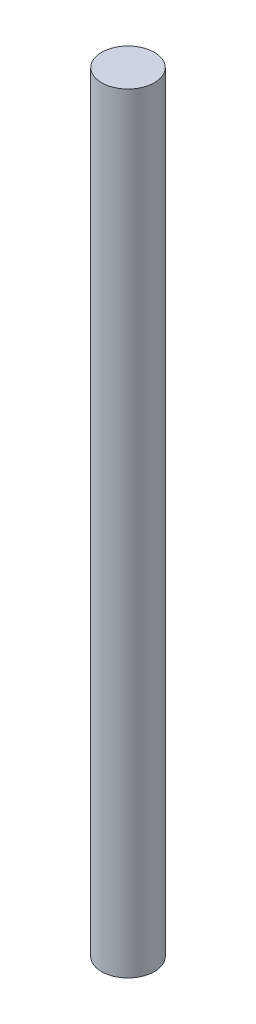
ISO-10303-21;
HEADER;
FILE_DESCRIPTION(('STEP AP214'),'2;1');
FILE_NAME('part.step','',(''),(''),'','','');
FILE_SCHEMA(('AUTOMOTIVE_DESIGN { 1 0 10303 214 1 1 1 1 }'));
ENDSEC;
DATA;
#1=APPLICATION_CONTEXT('core data for automotive mechanical design processes');
#2=APPLICATION_PROTOCOL_DEFINITION('international standard','automotive_design',2000,#1);
#3=PRODUCT_CONTEXT('',#1,'mechanical');
#4=PRODUCT('Part','Part','',(#3));
#5=PRODUCT_RELATED_PRODUCT_CATEGORY('part','',(#4));
#6=PRODUCT_DEFINITION_FORMATION('','',#4);
#7=PRODUCT_DEFINITION_CONTEXT('part definition',#1,'design');
#8=PRODUCT_DEFINITION('design','',#6,#7);
#9=PRODUCT_DEFINITION_SHAPE('','',#8);
#10=(LENGTH_UNIT() NAMED_UNIT(*) SI_UNIT(.MILLI.,.METRE.));
#11=(NAMED_UNIT(*) PLANE_ANGLE_UNIT() SI_UNIT($,.RADIAN.));
#12=(NAMED_UNIT(*) SI_UNIT($,.STERADIAN.) SOLID_ANGLE_UNIT());
#13=UNCERTAINTY_MEASURE_WITH_UNIT(LENGTH_MEASURE(1.E-05),#10,'distance_accuracy_value','');
#14=(GEOMETRIC_REPRESENTATION_CONTEXT(3) GLOBAL_UNCERTAINTY_ASSIGNED_CONTEXT((#13)) GLOBAL_UNIT_ASSIGNED_CONTEXT((#10,
#11,#12)) REPRESENTATION_CONTEXT('',''));
#15=CARTESIAN_POINT('',(0.,0.,0.));
#16=DIRECTION('',(0.,0.,1.));
#17=DIRECTION('',(1.,0.,0.));
#18=AXIS2_PLACEMENT_3D('',#15,#16,#17);
#19=CARTESIAN_POINT('',(0.,73.,0.));
#20=DIRECTION('',(0.,-1.,0.));
#21=DIRECTION('',(0.,0.,-1.));
#22=AXIS2_PLACEMENT_3D('',#19,#20,#21);
#23=CYLINDRICAL_SURFACE('',#22,2.5);
#24=CARTESIAN_POINT('',(0.,73.,0.));
#25=DIRECTION('',(0.,1.,0.));
#26=DIRECTION('',(0.,0.,1.));
#27=AXIS2_PLACEMENT_3D('',#24,#25,#26);
#28=CIRCLE('',#27,2.5);
#29=CARTESIAN_POINT('',(0.,73.,2.5));
#30=VERTEX_POINT('',#29);
#31=EDGE_CURVE('E10',#30,#30,#28,.T.);
#32=ORIENTED_EDGE('',*,*,#31,.F.);
#33=EDGE_LOOP('',(#32));
#34=FACE_BOUND('',#33,.T.);
#35=CARTESIAN_POINT('',(0.,0.,0.));
#36=DIRECTION('',(0.,1.,0.));
#37=DIRECTION('',(0.,0.,1.));
#38=AXIS2_PLACEMENT_3D('',#35,#36,#37);
#39=CIRCLE('',#38,2.5);
#40=CARTESIAN_POINT('',(0.,0.,2.5));
#41=VERTEX_POINT('',#40);
#42=EDGE_CURVE('E32',#41,#41,#39,.T.);
#43=ORIENTED_EDGE('',*,*,#42,.T.);
#44=EDGE_LOOP('',(#43));
#45=FACE_BOUND('',#44,.T.);
#46=ADVANCED_FACE('F29',(#34,#45),#23,.T.);
#47=CARTESIAN_POINT('',(0.,73.,0.));
#48=DIRECTION('',(0.,1.,0.));
#49=DIRECTION('',(0.,0.,1.));
#50=AXIS2_PLACEMENT_3D('',#47,#48,#49);
#51=PLANE('',#50);
#52=ORIENTED_EDGE('',*,*,#31,.T.);
#53=EDGE_LOOP('',(#52));
#54=FACE_BOUND('',#53,.T.);
#55=ADVANCED_FACE('F44',(#54),#51,.T.);
#56=CARTESIAN_POINT('',(0.,0.,0.));
#57=DIRECTION('',(0.,1.,0.));
#58=DIRECTION('',(0.,0.,1.));
#59=AXIS2_PLACEMENT_3D('',#56,#57,#58);
#60=PLANE('',#59);
#61=ORIENTED_EDGE('',*,*,#42,.F.);
#62=EDGE_LOOP('',(#61));
#63=FACE_BOUND('',#62,.T.);
#64=ADVANCED_FACE('F42',(#63),#60,.F.);
#65=CLOSED_SHELL('',(#46,#55,#64));
#66=MANIFOLD_SOLID_BREP('B2',#65);
#67=ADVANCED_BREP_SHAPE_REPRESENTATION('',(#18,#66),#14);
#68=SHAPE_DEFINITION_REPRESENTATION(#9,#67);
ENDSEC;
END-ISO-10303-21;
